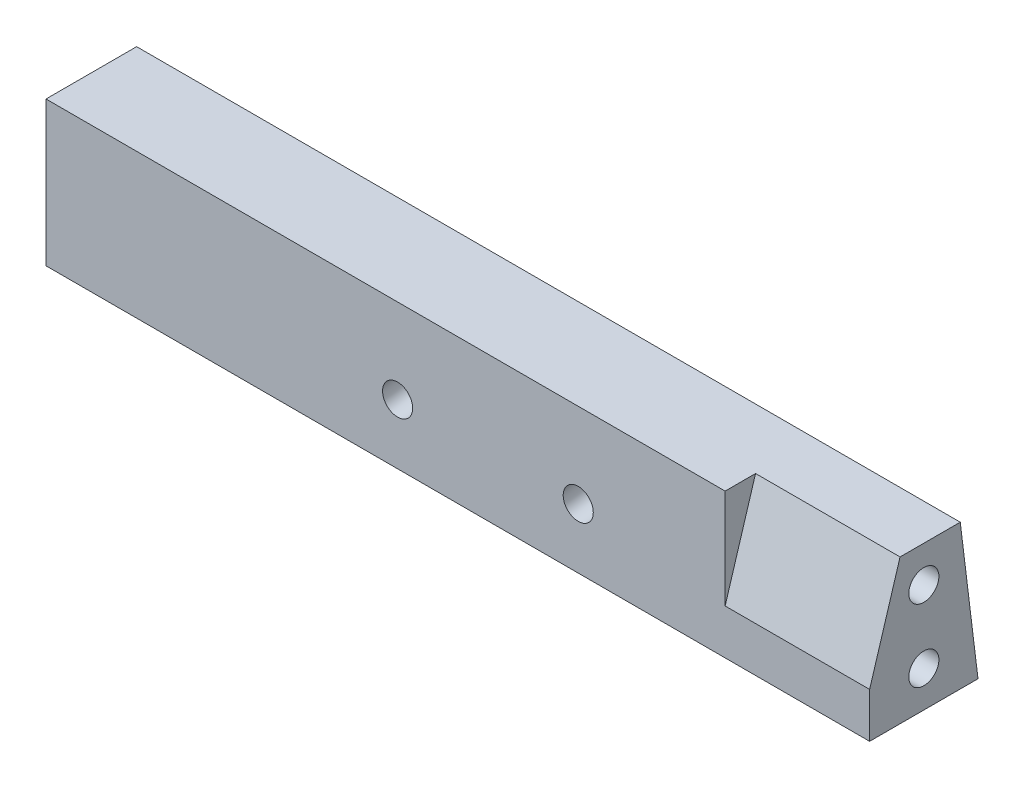
ISO-10303-21;
HEADER;
FILE_DESCRIPTION(('STEP AP214'),'2;1');
FILE_NAME('part.step','',(''),(''),'','','');
FILE_SCHEMA(('AUTOMOTIVE_DESIGN { 1 0 10303 214 1 1 1 1 }'));
ENDSEC;
DATA;
#1=APPLICATION_CONTEXT('core data for automotive mechanical design processes');
#2=APPLICATION_PROTOCOL_DEFINITION('international standard','automotive_design',2000,#1);
#3=PRODUCT_CONTEXT('',#1,'mechanical');
#4=PRODUCT('Part','Part','',(#3));
#5=PRODUCT_RELATED_PRODUCT_CATEGORY('part','',(#4));
#6=PRODUCT_DEFINITION_FORMATION('','',#4);
#7=PRODUCT_DEFINITION_CONTEXT('part definition',#1,'design');
#8=PRODUCT_DEFINITION('design','',#6,#7);
#9=PRODUCT_DEFINITION_SHAPE('','',#8);
#10=(LENGTH_UNIT() NAMED_UNIT(*) SI_UNIT(.MILLI.,.METRE.));
#11=(NAMED_UNIT(*) PLANE_ANGLE_UNIT() SI_UNIT($,.RADIAN.));
#12=(NAMED_UNIT(*) SI_UNIT($,.STERADIAN.) SOLID_ANGLE_UNIT());
#13=UNCERTAINTY_MEASURE_WITH_UNIT(LENGTH_MEASURE(1.E-05),#10,'distance_accuracy_value','');
#14=(GEOMETRIC_REPRESENTATION_CONTEXT(3) GLOBAL_UNCERTAINTY_ASSIGNED_CONTEXT((#13)) GLOBAL_UNIT_ASSIGNED_CONTEXT((#10,
#11,#12)) REPRESENTATION_CONTEXT('',''));
#15=CARTESIAN_POINT('',(0.,0.,0.));
#16=DIRECTION('',(0.,0.,1.));
#17=DIRECTION('',(1.,0.,0.));
#18=AXIS2_PLACEMENT_3D('',#15,#16,#17);
#19=CARTESIAN_POINT('',(68.4,6.,-3.02658526916514));
#20=DIRECTION('',(0.,-0.121869343405148,0.992546151641322));
#21=DIRECTION('',(0.,-0.992546151641322,-0.121869343405148));
#22=AXIS2_PLACEMENT_3D('',#19,#20,#21);
#23=PLANE('',#22);
#24=CARTESIAN_POINT('',(44.1999999999984,-0.0057590698231061,-3.76399975944201));
#25=DIRECTION('',(0.,0.121869343405148,-0.992546151641322));
#26=DIRECTION('',(0.,0.992546151641322,0.121869343405148));
#27=AXIS2_PLACEMENT_3D('',#24,#25,#26);
#28=CIRCLE('',#27,1.25);
#29=CARTESIAN_POINT('',(44.1999999999984,1.23492361972855,-3.61166308018557));
#30=VERTEX_POINT('',#29);
#31=EDGE_CURVE('E265',#30,#30,#28,.T.);
#32=ORIENTED_EDGE('',*,*,#31,.F.);
#33=EDGE_LOOP('',(#32));
#34=FACE_BOUND('',#33,.T.);
#35=DIRECTION('',(0.,0.992546151641322,0.121869343405148));
#36=VECTOR('',#35,1.);
#37=CARTESIAN_POINT('',(0.,6.,-3.02658526916514));
#38=LINE('',#37,#36);
#39=CARTESIAN_POINT('',(0.,-6.,-4.5));
#40=VERTEX_POINT('',#39);
#41=CARTESIAN_POINT('',(0.,6.,-3.02658526916514));
#42=VERTEX_POINT('',#41);
#43=EDGE_CURVE('E170',#40,#42,#38,.T.);
#44=ORIENTED_EDGE('',*,*,#43,.T.);
#45=DIRECTION('',(-1.,0.,0.));
#46=VECTOR('',#45,1.);
#47=CARTESIAN_POINT('',(68.4,6.,-3.02658526916514));
#48=LINE('',#47,#46);
#49=CARTESIAN_POINT('',(68.4,6.,-3.02658526916514));
#50=VERTEX_POINT('',#49);
#51=EDGE_CURVE('E174',#50,#42,#48,.T.);
#52=ORIENTED_EDGE('',*,*,#51,.F.);
#53=DIRECTION('',(0.,0.992546151641322,0.121869343405148));
#54=VECTOR('',#53,1.);
#55=CARTESIAN_POINT('',(68.4,6.,-3.02658526916514));
#56=LINE('',#55,#54);
#57=CARTESIAN_POINT('',(68.4,-6.,-4.5));
#58=VERTEX_POINT('',#57);
#59=EDGE_CURVE('E61',#58,#50,#56,.T.);
#60=ORIENTED_EDGE('',*,*,#59,.F.);
#61=DIRECTION('',(-1.,0.,0.));
#62=VECTOR('',#61,1.);
#63=CARTESIAN_POINT('',(68.4,-6.,-4.5));
#64=LINE('',#63,#62);
#65=EDGE_CURVE('E45',#58,#40,#64,.T.);
#66=ORIENTED_EDGE('',*,*,#65,.T.);
#67=EDGE_LOOP('',(#44,#52,#60,#66));
#68=FACE_BOUND('',#67,.T.);
#69=CARTESIAN_POINT('',(29.1999999999984,-0.00575906982309922,-3.76399975944201));
#70=DIRECTION('',(0.,0.121869343405148,-0.992546151641322));
#71=DIRECTION('',(0.,0.992546151641322,0.121869343405148));
#72=AXIS2_PLACEMENT_3D('',#69,#70,#71);
#73=CIRCLE('',#72,1.25);
#74=CARTESIAN_POINT('',(29.1999999999984,1.23492361972855,-3.61166308018557));
#75=VERTEX_POINT('',#74);
#76=EDGE_CURVE('E263',#75,#75,#73,.T.);
#77=ORIENTED_EDGE('',*,*,#76,.F.);
#78=EDGE_LOOP('',(#77));
#79=FACE_BOUND('',#78,.T.);
#80=ADVANCED_FACE('F37',(#34,#68,#79),#23,.F.);
#81=CARTESIAN_POINT('',(68.4,-6.,4.5));
#82=DIRECTION('',(0.,0.,-1.));
#83=DIRECTION('',(-1.,0.,0.));
#84=AXIS2_PLACEMENT_3D('',#81,#82,#83);
#85=PLANE('',#84);
#86=CARTESIAN_POINT('',(29.1999999999984,-1.0204506515879,4.5));
#87=DIRECTION('',(0.,0.,-1.));
#88=DIRECTION('',(0.,1.,0.));
#89=AXIS2_PLACEMENT_3D('',#86,#87,#88);
#90=ELLIPSE('',#89,1.25938728182356,1.25);
#91=CARTESIAN_POINT('',(29.1999999999984,0.238936630235658,4.5));
#92=VERTEX_POINT('',#91);
#93=EDGE_CURVE('E260',#92,#92,#90,.T.);
#94=ORIENTED_EDGE('',*,*,#93,.T.);
#95=EDGE_LOOP('',(#94));
#96=FACE_BOUND('',#95,.T.);
#97=CARTESIAN_POINT('',(44.1999999999984,-1.02045065158791,4.5));
#98=DIRECTION('',(0.,0.,-1.));
#99=DIRECTION('',(0.,1.,0.));
#100=AXIS2_PLACEMENT_3D('',#97,#98,#99);
#101=ELLIPSE('',#100,1.25938728182356,1.25);
#102=CARTESIAN_POINT('',(44.1999999999984,0.238936630235654,4.5));
#103=VERTEX_POINT('',#102);
#104=EDGE_CURVE('E128',#103,#103,#101,.T.);
#105=ORIENTED_EDGE('',*,*,#104,.T.);
#106=EDGE_LOOP('',(#105));
#107=FACE_BOUND('',#106,.T.);
#108=DIRECTION('',(0.,-1.,0.));
#109=VECTOR('',#108,1.);
#110=CARTESIAN_POINT('',(68.4,-6.,4.5));
#111=LINE('',#110,#109);
#112=CARTESIAN_POINT('',(68.4,-2.26408804347244,4.5));
#113=VERTEX_POINT('',#112);
#114=CARTESIAN_POINT('',(68.4,-6.,4.5));
#115=VERTEX_POINT('',#114);
#116=EDGE_CURVE('E86',#113,#115,#111,.T.);
#117=ORIENTED_EDGE('',*,*,#116,.F.);
#118=DIRECTION('',(1.,0.,0.));
#119=VECTOR('',#118,1.);
#120=CARTESIAN_POINT('',(56.4,-2.26408804347244,4.5));
#121=LINE('',#120,#119);
#122=CARTESIAN_POINT('',(56.4,-2.26408804347244,4.5));
#123=VERTEX_POINT('',#122);
#124=EDGE_CURVE('E52',#123,#113,#121,.T.);
#125=ORIENTED_EDGE('',*,*,#124,.F.);
#126=DIRECTION('',(0.,-1.,0.));
#127=VECTOR('',#126,1.);
#128=CARTESIAN_POINT('',(56.4,-2.26408804347244,4.5));
#129=LINE('',#128,#127);
#130=CARTESIAN_POINT('',(56.4,6.,4.5));
#131=VERTEX_POINT('',#130);
#132=EDGE_CURVE('E149',#131,#123,#129,.T.);
#133=ORIENTED_EDGE('',*,*,#132,.F.);
#134=DIRECTION('',(-1.,0.,0.));
#135=VECTOR('',#134,1.);
#136=CARTESIAN_POINT('',(68.4,6.,4.5));
#137=LINE('',#136,#135);
#138=CARTESIAN_POINT('',(0.,6.,4.5));
#139=VERTEX_POINT('',#138);
#140=EDGE_CURVE('E82',#131,#139,#137,.T.);
#141=ORIENTED_EDGE('',*,*,#140,.T.);
#142=DIRECTION('',(0.,-1.,0.));
#143=VECTOR('',#142,1.);
#144=CARTESIAN_POINT('',(0.,-6.,4.5));
#145=LINE('',#144,#143);
#146=CARTESIAN_POINT('',(0.,-6.,4.5));
#147=VERTEX_POINT('',#146);
#148=EDGE_CURVE('E158',#139,#147,#145,.T.);
#149=ORIENTED_EDGE('',*,*,#148,.T.);
#150=DIRECTION('',(-1.,0.,0.));
#151=VECTOR('',#150,1.);
#152=CARTESIAN_POINT('',(68.4,-6.,4.5));
#153=LINE('',#152,#151);
#154=EDGE_CURVE('E11',#115,#147,#153,.T.);
#155=ORIENTED_EDGE('',*,*,#154,.F.);
#156=EDGE_LOOP('',(#117,#125,#133,#141,#149,#155));
#157=FACE_BOUND('',#156,.T.);
#158=ADVANCED_FACE('F39',(#96,#107,#157),#85,.F.);
#159=CARTESIAN_POINT('',(68.4,-6.,4.5));
#160=DIRECTION('',(0.,1.,0.));
#161=DIRECTION('',(0.,0.,1.));
#162=AXIS2_PLACEMENT_3D('',#159,#160,#161);
#163=PLANE('',#162);
#164=DIRECTION('',(0.,0.,-1.));
#165=VECTOR('',#164,1.);
#166=CARTESIAN_POINT('',(0.,-6.,4.5));
#167=LINE('',#166,#165);
#168=EDGE_CURVE('E168',#147,#40,#167,.T.);
#169=ORIENTED_EDGE('',*,*,#168,.T.);
#170=ORIENTED_EDGE('',*,*,#65,.F.);
#171=DIRECTION('',(0.,0.,-1.));
#172=VECTOR('',#171,1.);
#173=CARTESIAN_POINT('',(68.4,-6.,4.5));
#174=LINE('',#173,#172);
#175=EDGE_CURVE('E161',#115,#58,#174,.T.);
#176=ORIENTED_EDGE('',*,*,#175,.F.);
#177=ORIENTED_EDGE('',*,*,#154,.T.);
#178=EDGE_LOOP('',(#169,#170,#176,#177));
#179=FACE_BOUND('',#178,.T.);
#180=ADVANCED_FACE('F192',(#179),#163,.F.);
#181=CARTESIAN_POINT('',(68.4,6.,4.5));
#182=DIRECTION('',(0.,-1.,0.));
#183=DIRECTION('',(0.,0.,-1.));
#184=AXIS2_PLACEMENT_3D('',#181,#182,#183);
#185=PLANE('',#184);
#186=DIRECTION('',(0.,0.,1.));
#187=VECTOR('',#186,1.);
#188=CARTESIAN_POINT('',(56.4,6.,4.5));
#189=LINE('',#188,#187);
#190=CARTESIAN_POINT('',(56.4,6.,1.97341473083486));
#191=VERTEX_POINT('',#190);
#192=EDGE_CURVE('E147',#191,#131,#189,.T.);
#193=ORIENTED_EDGE('',*,*,#192,.F.);
#194=DIRECTION('',(1.,0.,0.));
#195=VECTOR('',#194,1.);
#196=CARTESIAN_POINT('',(56.4,6.,1.97341473083486));
#197=LINE('',#196,#195);
#198=CARTESIAN_POINT('',(68.4,6.,1.97341473083486));
#199=VERTEX_POINT('',#198);
#200=EDGE_CURVE('E155',#191,#199,#197,.T.);
#201=ORIENTED_EDGE('',*,*,#200,.T.);
#202=DIRECTION('',(0.,0.,1.));
#203=VECTOR('',#202,1.);
#204=CARTESIAN_POINT('',(68.4,6.,4.5));
#205=LINE('',#204,#203);
#206=EDGE_CURVE('E165',#50,#199,#205,.T.);
#207=ORIENTED_EDGE('',*,*,#206,.F.);
#208=ORIENTED_EDGE('',*,*,#51,.T.);
#209=DIRECTION('',(0.,0.,1.));
#210=VECTOR('',#209,1.);
#211=CARTESIAN_POINT('',(0.,6.,4.5));
#212=LINE('',#211,#210);
#213=EDGE_CURVE('E162',#42,#139,#212,.T.);
#214=ORIENTED_EDGE('',*,*,#213,.T.);
#215=ORIENTED_EDGE('',*,*,#140,.F.);
#216=EDGE_LOOP('',(#193,#201,#207,#208,#214,#215));
#217=FACE_BOUND('',#216,.T.);
#218=ADVANCED_FACE('F188',(#217),#185,.F.);
#219=CARTESIAN_POINT('',(68.4,0.,0.));
#220=DIRECTION('',(-1.,0.,0.));
#221=DIRECTION('',(0.,0.,1.));
#222=AXIS2_PLACEMENT_3D('',#219,#220,#221);
#223=PLANE('',#222);
#224=CARTESIAN_POINT('',(68.4,-3.,0.));
#225=DIRECTION('',(1.,0.,0.));
#226=DIRECTION('',(0.,0.,-1.));
#227=AXIS2_PLACEMENT_3D('',#224,#225,#226);
#228=CIRCLE('',#227,1.24999999999999);
#229=CARTESIAN_POINT('',(68.4,-3.,-1.24999999999999));
#230=VERTEX_POINT('',#229);
#231=EDGE_CURVE('E134',#230,#230,#228,.T.);
#232=ORIENTED_EDGE('',*,*,#231,.F.);
#233=EDGE_LOOP('',(#232));
#234=FACE_BOUND('',#233,.T.);
#235=CARTESIAN_POINT('',(68.4,3.,0.));
#236=DIRECTION('',(1.,0.,0.));
#237=DIRECTION('',(0.,0.,-1.));
#238=AXIS2_PLACEMENT_3D('',#235,#236,#237);
#239=CIRCLE('',#238,1.24999999999999);
#240=CARTESIAN_POINT('',(68.4,3.,-1.24999999999999));
#241=VERTEX_POINT('',#240);
#242=EDGE_CURVE('E140',#241,#241,#239,.T.);
#243=ORIENTED_EDGE('',*,*,#242,.F.);
#244=EDGE_LOOP('',(#243));
#245=FACE_BOUND('',#244,.T.);
#246=ORIENTED_EDGE('',*,*,#206,.T.);
#247=DIRECTION('',(0.,0.956304755963037,-0.29237170472273));
#248=VECTOR('',#247,1.);
#249=CARTESIAN_POINT('',(68.4,6.,1.97341473083486));
#250=LINE('',#249,#248);
#251=EDGE_CURVE('E146',#113,#199,#250,.T.);
#252=ORIENTED_EDGE('',*,*,#251,.F.);
#253=ORIENTED_EDGE('',*,*,#116,.T.);
#254=ORIENTED_EDGE('',*,*,#175,.T.);
#255=ORIENTED_EDGE('',*,*,#59,.T.);
#256=EDGE_LOOP('',(#246,#252,#253,#254,#255));
#257=FACE_BOUND('',#256,.T.);
#258=ADVANCED_FACE('F190',(#234,#245,#257),#223,.F.);
#259=CARTESIAN_POINT('',(0.,0.,0.));
#260=DIRECTION('',(-1.,0.,0.));
#261=DIRECTION('',(0.,0.,1.));
#262=AXIS2_PLACEMENT_3D('',#259,#260,#261);
#263=PLANE('',#262);
#264=CARTESIAN_POINT('',(0.,3.,0.));
#265=DIRECTION('',(-1.,0.,0.));
#266=DIRECTION('',(0.,0.,1.));
#267=AXIS2_PLACEMENT_3D('',#264,#265,#266);
#268=CIRCLE('',#267,1.24999999999999);
#269=CARTESIAN_POINT('',(0.,3.,1.24999999999999));
#270=VERTEX_POINT('',#269);
#271=EDGE_CURVE('E122',#270,#270,#268,.T.);
#272=ORIENTED_EDGE('',*,*,#271,.F.);
#273=EDGE_LOOP('',(#272));
#274=FACE_BOUND('',#273,.T.);
#275=CARTESIAN_POINT('',(0.,-3.,0.));
#276=DIRECTION('',(-1.,0.,0.));
#277=DIRECTION('',(0.,0.,1.));
#278=AXIS2_PLACEMENT_3D('',#275,#276,#277);
#279=CIRCLE('',#278,1.24999999999999);
#280=CARTESIAN_POINT('',(0.,-3.,1.24999999999999));
#281=VERTEX_POINT('',#280);
#282=EDGE_CURVE('E121',#281,#281,#279,.T.);
#283=ORIENTED_EDGE('',*,*,#282,.F.);
#284=EDGE_LOOP('',(#283));
#285=FACE_BOUND('',#284,.T.);
#286=ORIENTED_EDGE('',*,*,#148,.F.);
#287=ORIENTED_EDGE('',*,*,#213,.F.);
#288=ORIENTED_EDGE('',*,*,#43,.F.);
#289=ORIENTED_EDGE('',*,*,#168,.F.);
#290=EDGE_LOOP('',(#286,#287,#288,#289));
#291=FACE_BOUND('',#290,.T.);
#292=ADVANCED_FACE('F185',(#274,#285,#291),#263,.T.);
#293=CARTESIAN_POINT('',(56.4,6.,1.97341473083486));
#294=DIRECTION('',(0.,-0.29237170472273,-0.956304755963037));
#295=DIRECTION('',(0.,0.956304755963037,-0.29237170472273));
#296=AXIS2_PLACEMENT_3D('',#293,#294,#295);
#297=PLANE('',#296);
#298=ORIENTED_EDGE('',*,*,#251,.T.);
#299=ORIENTED_EDGE('',*,*,#200,.F.);
#300=DIRECTION('',(0.,0.956304755963037,-0.29237170472273));
#301=VECTOR('',#300,1.);
#302=CARTESIAN_POINT('',(56.4,6.,1.97341473083486));
#303=LINE('',#302,#301);
#304=EDGE_CURVE('E151',#123,#191,#303,.T.);
#305=ORIENTED_EDGE('',*,*,#304,.F.);
#306=ORIENTED_EDGE('',*,*,#124,.T.);
#307=EDGE_LOOP('',(#298,#299,#305,#306));
#308=FACE_BOUND('',#307,.T.);
#309=ADVANCED_FACE('F212',(#308),#297,.F.);
#310=CARTESIAN_POINT('',(56.4,0.,0.));
#311=DIRECTION('',(1.,0.,0.));
#312=DIRECTION('',(0.,0.,-1.));
#313=AXIS2_PLACEMENT_3D('',#310,#311,#312);
#314=PLANE('',#313);
#315=ORIENTED_EDGE('',*,*,#192,.T.);
#316=ORIENTED_EDGE('',*,*,#132,.T.);
#317=ORIENTED_EDGE('',*,*,#304,.T.);
#318=EDGE_LOOP('',(#315,#316,#317));
#319=FACE_BOUND('',#318,.T.);
#320=ADVANCED_FACE('F219',(#319),#314,.T.);
#321=CARTESIAN_POINT('',(59.9,3.,0.));
#322=DIRECTION('',(1.,0.,0.));
#323=DIRECTION('',(0.,0.,-1.));
#324=AXIS2_PLACEMENT_3D('',#321,#322,#323);
#325=CONICAL_SURFACE('',#324,1.25,1.02974425867665);
#326=CARTESIAN_POINT('',(59.1489242262155,3.,0.));
#327=VERTEX_POINT('',#326);
#328=VERTEX_LOOP('',#327);
#329=FACE_BOUND('',#328,.T.);
#330=CARTESIAN_POINT('',(59.9,3.,0.));
#331=DIRECTION('',(1.,0.,0.));
#332=DIRECTION('',(0.,0.,-1.));
#333=AXIS2_PLACEMENT_3D('',#330,#331,#332);
#334=CIRCLE('',#333,1.25);
#335=CARTESIAN_POINT('',(59.9,3.,-1.25));
#336=VERTEX_POINT('',#335);
#337=EDGE_CURVE('E143',#336,#336,#334,.T.);
#338=ORIENTED_EDGE('',*,*,#337,.T.);
#339=EDGE_LOOP('',(#338));
#340=FACE_BOUND('',#339,.T.);
#341=ADVANCED_FACE('F222',(#329,#340),#325,.F.);
#342=CARTESIAN_POINT('',(68.4,3.,0.));
#343=DIRECTION('',(1.,0.,0.));
#344=DIRECTION('',(0.,0.,-1.));
#345=AXIS2_PLACEMENT_3D('',#342,#343,#344);
#346=CYLINDRICAL_SURFACE('',#345,1.24999999999999);
#347=ORIENTED_EDGE('',*,*,#337,.F.);
#348=EDGE_LOOP('',(#347));
#349=FACE_BOUND('',#348,.T.);
#350=ORIENTED_EDGE('',*,*,#242,.T.);
#351=EDGE_LOOP('',(#350));
#352=FACE_BOUND('',#351,.T.);
#353=ADVANCED_FACE('F226',(#349,#352),#346,.F.);
#354=CARTESIAN_POINT('',(59.9,-3.,0.));
#355=DIRECTION('',(1.,0.,0.));
#356=DIRECTION('',(0.,0.,-1.));
#357=AXIS2_PLACEMENT_3D('',#354,#355,#356);
#358=CONICAL_SURFACE('',#357,1.25,1.02974425867665);
#359=CARTESIAN_POINT('',(59.1489242262155,-3.,0.));
#360=VERTEX_POINT('',#359);
#361=VERTEX_LOOP('',#360);
#362=FACE_BOUND('',#361,.T.);
#363=CARTESIAN_POINT('',(59.9,-3.,0.));
#364=DIRECTION('',(1.,0.,0.));
#365=DIRECTION('',(0.,0.,-1.));
#366=AXIS2_PLACEMENT_3D('',#363,#364,#365);
#367=CIRCLE('',#366,1.25);
#368=CARTESIAN_POINT('',(59.9,-3.,-1.25));
#369=VERTEX_POINT('',#368);
#370=EDGE_CURVE('E137',#369,#369,#367,.T.);
#371=ORIENTED_EDGE('',*,*,#370,.T.);
#372=EDGE_LOOP('',(#371));
#373=FACE_BOUND('',#372,.T.);
#374=ADVANCED_FACE('F230',(#362,#373),#358,.F.);
#375=CARTESIAN_POINT('',(68.4,-3.,0.));
#376=DIRECTION('',(1.,0.,0.));
#377=DIRECTION('',(0.,0.,-1.));
#378=AXIS2_PLACEMENT_3D('',#375,#376,#377);
#379=CYLINDRICAL_SURFACE('',#378,1.24999999999999);
#380=ORIENTED_EDGE('',*,*,#370,.F.);
#381=EDGE_LOOP('',(#380));
#382=FACE_BOUND('',#381,.T.);
#383=ORIENTED_EDGE('',*,*,#231,.T.);
#384=EDGE_LOOP('',(#383));
#385=FACE_BOUND('',#384,.T.);
#386=ADVANCED_FACE('F234',(#382,#385),#379,.F.);
#387=CARTESIAN_POINT('',(8.49999999999999,-3.,0.));
#388=DIRECTION('',(-1.,0.,0.));
#389=DIRECTION('',(0.,0.,1.));
#390=AXIS2_PLACEMENT_3D('',#387,#388,#389);
#391=CONICAL_SURFACE('',#390,1.24999999999999,1.02974425867665);
#392=CARTESIAN_POINT('',(9.25107577378444,-3.,0.));
#393=VERTEX_POINT('',#392);
#394=VERTEX_LOOP('',#393);
#395=FACE_BOUND('',#394,.T.);
#396=CARTESIAN_POINT('',(8.49999999999999,-3.,0.));
#397=DIRECTION('',(-1.,0.,0.));
#398=DIRECTION('',(0.,0.,1.));
#399=AXIS2_PLACEMENT_3D('',#396,#397,#398);
#400=CIRCLE('',#399,1.24999999999999);
#401=CARTESIAN_POINT('',(8.49999999999999,-3.,1.24999999999999));
#402=VERTEX_POINT('',#401);
#403=EDGE_CURVE('E125',#402,#402,#400,.T.);
#404=ORIENTED_EDGE('',*,*,#403,.T.);
#405=EDGE_LOOP('',(#404));
#406=FACE_BOUND('',#405,.T.);
#407=ADVANCED_FACE('F238',(#395,#406),#391,.F.);
#408=CARTESIAN_POINT('',(0.,-3.,0.));
#409=DIRECTION('',(-1.,0.,0.));
#410=DIRECTION('',(0.,0.,1.));
#411=AXIS2_PLACEMENT_3D('',#408,#409,#410);
#412=CYLINDRICAL_SURFACE('',#411,1.24999999999999);
#413=ORIENTED_EDGE('',*,*,#403,.F.);
#414=EDGE_LOOP('',(#413));
#415=FACE_BOUND('',#414,.T.);
#416=ORIENTED_EDGE('',*,*,#282,.T.);
#417=EDGE_LOOP('',(#416));
#418=FACE_BOUND('',#417,.T.);
#419=ADVANCED_FACE('F115',(#415,#418),#412,.F.);
#420=CARTESIAN_POINT('',(8.49999999999999,3.,0.));
#421=DIRECTION('',(-1.,0.,0.));
#422=DIRECTION('',(0.,0.,1.));
#423=AXIS2_PLACEMENT_3D('',#420,#421,#422);
#424=CONICAL_SURFACE('',#423,1.24999999999999,1.02974425867665);
#425=CARTESIAN_POINT('',(9.25107577378444,3.,0.));
#426=VERTEX_POINT('',#425);
#427=VERTEX_LOOP('',#426);
#428=FACE_BOUND('',#427,.T.);
#429=CARTESIAN_POINT('',(8.49999999999999,3.,0.));
#430=DIRECTION('',(-1.,0.,0.));
#431=DIRECTION('',(0.,0.,1.));
#432=AXIS2_PLACEMENT_3D('',#429,#430,#431);
#433=CIRCLE('',#432,1.24999999999999);
#434=CARTESIAN_POINT('',(8.49999999999999,3.,1.24999999999999));
#435=VERTEX_POINT('',#434);
#436=EDGE_CURVE('E119',#435,#435,#433,.T.);
#437=ORIENTED_EDGE('',*,*,#436,.T.);
#438=EDGE_LOOP('',(#437));
#439=FACE_BOUND('',#438,.T.);
#440=ADVANCED_FACE('F111',(#428,#439),#424,.F.);
#441=CARTESIAN_POINT('',(0.,3.,0.));
#442=DIRECTION('',(-1.,0.,0.));
#443=DIRECTION('',(0.,0.,1.));
#444=AXIS2_PLACEMENT_3D('',#441,#442,#443);
#445=CYLINDRICAL_SURFACE('',#444,1.24999999999999);
#446=ORIENTED_EDGE('',*,*,#436,.F.);
#447=EDGE_LOOP('',(#446));
#448=FACE_BOUND('',#447,.T.);
#449=ORIENTED_EDGE('',*,*,#271,.T.);
#450=EDGE_LOOP('',(#449));
#451=FACE_BOUND('',#450,.T.);
#452=ADVANCED_FACE('F114',(#448,#451),#445,.F.);
#453=CARTESIAN_POINT('',(44.1999999999984,-0.0057590698231061,-3.76399975944201));
#454=DIRECTION('',(0.,0.121869343405148,-0.992546151641322));
#455=DIRECTION('',(0.,0.992546151641322,0.121869343405148));
#456=AXIS2_PLACEMENT_3D('',#453,#454,#455);
#457=CYLINDRICAL_SURFACE('',#456,1.25);
#458=ORIENTED_EDGE('',*,*,#104,.F.);
#459=EDGE_LOOP('',(#458));
#460=FACE_BOUND('',#459,.T.);
#461=ORIENTED_EDGE('',*,*,#31,.T.);
#462=EDGE_LOOP('',(#461));
#463=FACE_BOUND('',#462,.T.);
#464=ADVANCED_FACE('F248',(#460,#463),#457,.F.);
#465=CARTESIAN_POINT('',(29.1999999999984,-0.00575906982309922,-3.76399975944201));
#466=DIRECTION('',(0.,0.121869343405148,-0.992546151641322));
#467=DIRECTION('',(0.,0.992546151641322,0.121869343405148));
#468=AXIS2_PLACEMENT_3D('',#465,#466,#467);
#469=CYLINDRICAL_SURFACE('',#468,1.25);
#470=ORIENTED_EDGE('',*,*,#93,.F.);
#471=EDGE_LOOP('',(#470));
#472=FACE_BOUND('',#471,.T.);
#473=ORIENTED_EDGE('',*,*,#76,.T.);
#474=EDGE_LOOP('',(#473));
#475=FACE_BOUND('',#474,.T.);
#476=ADVANCED_FACE('F251',(#472,#475),#469,.F.);
#477=CLOSED_SHELL('',(#80,#158,#180,#218,#258,#292,#309,#320,#341,#353,#374,#386,#407,#419,#440,
#452,#464,#476));
#478=MANIFOLD_SOLID_BREP('B2',#477);
#479=ADVANCED_BREP_SHAPE_REPRESENTATION('',(#18,#478),#14);
#480=SHAPE_DEFINITION_REPRESENTATION(#9,#479);
ENDSEC;
END-ISO-10303-21;
